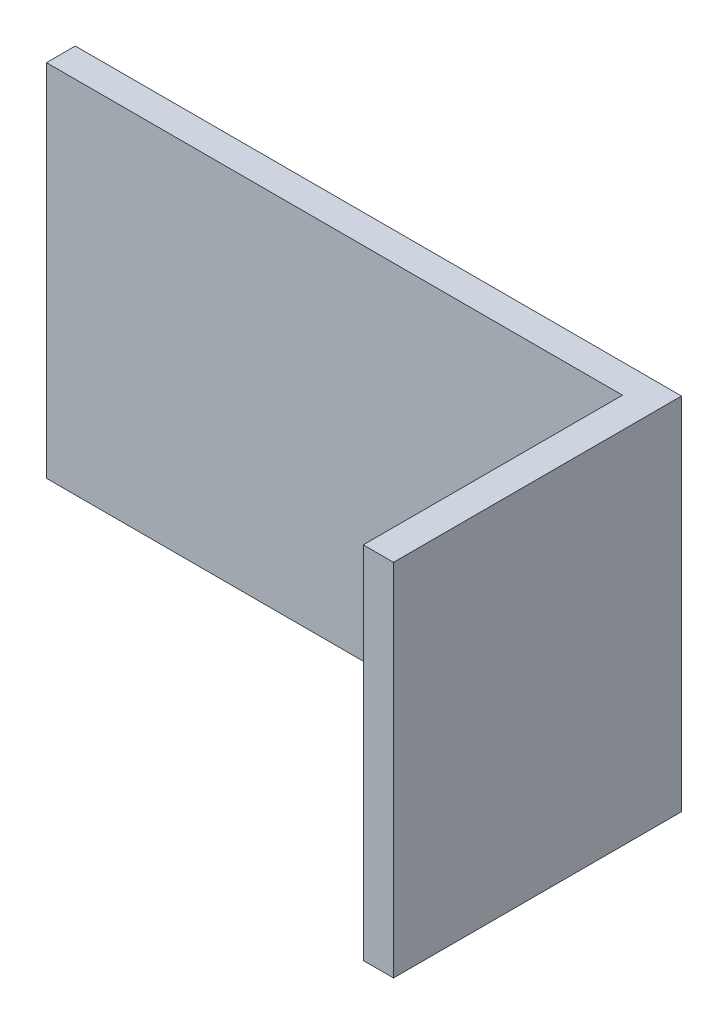
ISO-10303-21;
HEADER;
FILE_DESCRIPTION(('STEP AP214'),'2;1');
FILE_NAME('part.step','',(''),(''),'','','');
FILE_SCHEMA(('AUTOMOTIVE_DESIGN { 1 0 10303 214 1 1 1 1 }'));
ENDSEC;
DATA;
#1=APPLICATION_CONTEXT('core data for automotive mechanical design processes');
#2=APPLICATION_PROTOCOL_DEFINITION('international standard','automotive_design',2000,#1);
#3=PRODUCT_CONTEXT('',#1,'mechanical');
#4=PRODUCT('Part','Part','',(#3));
#5=PRODUCT_RELATED_PRODUCT_CATEGORY('part','',(#4));
#6=PRODUCT_DEFINITION_FORMATION('','',#4);
#7=PRODUCT_DEFINITION_CONTEXT('part definition',#1,'design');
#8=PRODUCT_DEFINITION('design','',#6,#7);
#9=PRODUCT_DEFINITION_SHAPE('','',#8);
#10=(LENGTH_UNIT() NAMED_UNIT(*) SI_UNIT(.MILLI.,.METRE.));
#11=(NAMED_UNIT(*) PLANE_ANGLE_UNIT() SI_UNIT($,.RADIAN.));
#12=(NAMED_UNIT(*) SI_UNIT($,.STERADIAN.) SOLID_ANGLE_UNIT());
#13=UNCERTAINTY_MEASURE_WITH_UNIT(LENGTH_MEASURE(1.E-05),#10,'distance_accuracy_value','');
#14=(GEOMETRIC_REPRESENTATION_CONTEXT(3) GLOBAL_UNCERTAINTY_ASSIGNED_CONTEXT((#13)) GLOBAL_UNIT_ASSIGNED_CONTEXT((#10,
#11,#12)) REPRESENTATION_CONTEXT('',''));
#15=CARTESIAN_POINT('',(0.,0.,0.));
#16=DIRECTION('',(0.,0.,1.));
#17=DIRECTION('',(1.,0.,0.));
#18=AXIS2_PLACEMENT_3D('',#15,#16,#17);
#19=CARTESIAN_POINT('',(1.48217930040456,-0.25,0.2));
#20=DIRECTION('',(0.,0.,1.));
#21=DIRECTION('',(1.,0.,0.));
#22=AXIS2_PLACEMENT_3D('',#19,#20,#21);
#23=PLANE('',#22);
#24=DIRECTION('',(0.,-1.,0.));
#25=VECTOR('',#24,1.);
#26=CARTESIAN_POINT('',(1.49267930040456,-0.25,0.2));
#27=LINE('',#26,#25);
#28=CARTESIAN_POINT('',(1.49267930040456,-0.125,0.2));
#29=VERTEX_POINT('',#28);
#30=CARTESIAN_POINT('',(1.49267930040456,-0.375,0.2));
#31=VERTEX_POINT('',#30);
#32=EDGE_CURVE('E76',#29,#31,#27,.T.);
#33=ORIENTED_EDGE('',*,*,#32,.F.);
#34=DIRECTION('',(1.,0.,0.));
#35=VECTOR('',#34,1.);
#36=CARTESIAN_POINT('',(1.34015031489732,-0.125,0.2));
#37=LINE('',#36,#35);
#38=CARTESIAN_POINT('',(1.47167930040457,-0.125,0.2));
#39=VERTEX_POINT('',#38);
#40=EDGE_CURVE('E127',#39,#29,#37,.T.);
#41=ORIENTED_EDGE('',*,*,#40,.F.);
#42=DIRECTION('',(0.,-1.,0.));
#43=VECTOR('',#42,1.);
#44=CARTESIAN_POINT('',(1.47167930040457,-0.25,0.2));
#45=LINE('',#44,#43);
#46=CARTESIAN_POINT('',(1.47167930040457,-0.375,0.2));
#47=VERTEX_POINT('',#46);
#48=EDGE_CURVE('E11',#39,#47,#45,.T.);
#49=ORIENTED_EDGE('',*,*,#48,.T.);
#50=DIRECTION('',(1.,0.,0.));
#51=VECTOR('',#50,1.);
#52=CARTESIAN_POINT('',(1.34015031489732,-0.375,0.2));
#53=LINE('',#52,#51);
#54=EDGE_CURVE('E66',#47,#31,#53,.T.);
#55=ORIENTED_EDGE('',*,*,#54,.T.);
#56=EDGE_LOOP('',(#33,#41,#49,#55));
#57=FACE_BOUND('',#56,.T.);
#58=ADVANCED_FACE('F17',(#57),#23,.T.);
#59=CARTESIAN_POINT('',(1.27167930040456,-0.25,0.02));
#60=DIRECTION('',(0.,0.,1.));
#61=DIRECTION('',(1.,0.,0.));
#62=AXIS2_PLACEMENT_3D('',#59,#60,#61);
#63=PLANE('',#62);
#64=DIRECTION('',(1.,0.,0.));
#65=VECTOR('',#64,1.);
#66=CARTESIAN_POINT('',(1.34015031489732,-0.125,0.02));
#67=LINE('',#66,#65);
#68=CARTESIAN_POINT('',(1.07167930040456,-0.125,0.02));
#69=VERTEX_POINT('',#68);
#70=CARTESIAN_POINT('',(1.47167930040457,-0.125,0.02));
#71=VERTEX_POINT('',#70);
#72=EDGE_CURVE('E110',#69,#71,#67,.T.);
#73=ORIENTED_EDGE('',*,*,#72,.F.);
#74=DIRECTION('',(0.,-1.,0.));
#75=VECTOR('',#74,1.);
#76=CARTESIAN_POINT('',(1.07167930040456,-0.25,0.02));
#77=LINE('',#76,#75);
#78=CARTESIAN_POINT('',(1.07167930040456,-0.375,0.02));
#79=VERTEX_POINT('',#78);
#80=EDGE_CURVE('E40',#69,#79,#77,.T.);
#81=ORIENTED_EDGE('',*,*,#80,.T.);
#82=DIRECTION('',(1.,0.,0.));
#83=VECTOR('',#82,1.);
#84=CARTESIAN_POINT('',(1.34015031489732,-0.375,0.02));
#85=LINE('',#84,#83);
#86=CARTESIAN_POINT('',(1.47167930040457,-0.375,0.02));
#87=VERTEX_POINT('',#86);
#88=EDGE_CURVE('E141',#79,#87,#85,.T.);
#89=ORIENTED_EDGE('',*,*,#88,.T.);
#90=DIRECTION('',(0.,1.,0.));
#91=VECTOR('',#90,1.);
#92=CARTESIAN_POINT('',(1.47167930040457,-0.25,0.02));
#93=LINE('',#92,#91);
#94=EDGE_CURVE('E20',#87,#71,#93,.T.);
#95=ORIENTED_EDGE('',*,*,#94,.T.);
#96=EDGE_LOOP('',(#73,#81,#89,#95));
#97=FACE_BOUND('',#96,.T.);
#98=ADVANCED_FACE('F117',(#97),#63,.T.);
#99=CARTESIAN_POINT('',(1.47167930040457,-0.25,0.11));
#100=DIRECTION('',(1.,0.,0.));
#101=DIRECTION('',(0.,0.,1.));
#102=AXIS2_PLACEMENT_3D('',#99,#100,#101);
#103=PLANE('',#102);
#104=DIRECTION('',(0.,0.,1.));
#105=VECTOR('',#104,1.);
#106=CARTESIAN_POINT('',(1.47167930040457,-0.125,0.0420289855072459));
#107=LINE('',#106,#105);
#108=EDGE_CURVE('E120',#71,#39,#107,.T.);
#109=ORIENTED_EDGE('',*,*,#108,.F.);
#110=ORIENTED_EDGE('',*,*,#94,.F.);
#111=DIRECTION('',(0.,0.,1.));
#112=VECTOR('',#111,1.);
#113=CARTESIAN_POINT('',(1.47167930040457,-0.375,0.0420289855072459));
#114=LINE('',#113,#112);
#115=EDGE_CURVE('E144',#87,#47,#114,.T.);
#116=ORIENTED_EDGE('',*,*,#115,.T.);
#117=ORIENTED_EDGE('',*,*,#48,.F.);
#118=EDGE_LOOP('',(#109,#110,#116,#117));
#119=FACE_BOUND('',#118,.T.);
#120=ADVANCED_FACE('F239',(#119),#103,.F.);
#121=CARTESIAN_POINT('',(1.07167930040456,-0.25,0.01));
#122=DIRECTION('',(1.,0.,0.));
#123=DIRECTION('',(0.,0.,1.));
#124=AXIS2_PLACEMENT_3D('',#121,#122,#123);
#125=PLANE('',#124);
#126=DIRECTION('',(0.,0.,1.));
#127=VECTOR('',#126,1.);
#128=CARTESIAN_POINT('',(1.07167930040456,-0.375,0.0420289855072459));
#129=LINE('',#128,#127);
#130=CARTESIAN_POINT('',(1.07167930040456,-0.375,0.));
#131=VERTEX_POINT('',#130);
#132=EDGE_CURVE('E102',#131,#79,#129,.T.);
#133=ORIENTED_EDGE('',*,*,#132,.T.);
#134=ORIENTED_EDGE('',*,*,#80,.F.);
#135=DIRECTION('',(0.,0.,1.));
#136=VECTOR('',#135,1.);
#137=CARTESIAN_POINT('',(1.07167930040456,-0.125,0.0420289855072459));
#138=LINE('',#137,#136);
#139=CARTESIAN_POINT('',(1.07167930040456,-0.125,0.));
#140=VERTEX_POINT('',#139);
#141=EDGE_CURVE('E97',#140,#69,#138,.T.);
#142=ORIENTED_EDGE('',*,*,#141,.F.);
#143=DIRECTION('',(0.,-1.,0.));
#144=VECTOR('',#143,1.);
#145=CARTESIAN_POINT('',(1.07167930040456,-0.25,0.));
#146=LINE('',#145,#144);
#147=EDGE_CURVE('E129',#140,#131,#146,.T.);
#148=ORIENTED_EDGE('',*,*,#147,.T.);
#149=EDGE_LOOP('',(#133,#134,#142,#148));
#150=FACE_BOUND('',#149,.T.);
#151=ADVANCED_FACE('F101',(#150),#125,.F.);
#152=CARTESIAN_POINT('',(1.34015031489732,-0.375,0.0420289855072459));
#153=DIRECTION('',(0.,1.,0.));
#154=DIRECTION('',(0.,0.,-1.));
#155=AXIS2_PLACEMENT_3D('',#152,#153,#154);
#156=PLANE('',#155);
#157=DIRECTION('',(0.,0.,-1.));
#158=VECTOR('',#157,1.);
#159=CARTESIAN_POINT('',(1.49267930040456,-0.375,0.0999999999999988));
#160=LINE('',#159,#158);
#161=CARTESIAN_POINT('',(1.49267930040456,-0.375,0.));
#162=VERTEX_POINT('',#161);
#163=EDGE_CURVE('E138',#31,#162,#160,.T.);
#164=ORIENTED_EDGE('',*,*,#163,.F.);
#165=ORIENTED_EDGE('',*,*,#54,.F.);
#166=ORIENTED_EDGE('',*,*,#115,.F.);
#167=ORIENTED_EDGE('',*,*,#88,.F.);
#168=ORIENTED_EDGE('',*,*,#132,.F.);
#169=DIRECTION('',(1.,0.,0.));
#170=VECTOR('',#169,1.);
#171=CARTESIAN_POINT('',(1.28217930040456,-0.375,0.));
#172=LINE('',#171,#170);
#173=EDGE_CURVE('E215',#131,#162,#172,.T.);
#174=ORIENTED_EDGE('',*,*,#173,.T.);
#175=EDGE_LOOP('',(#164,#165,#166,#167,#168,#174));
#176=FACE_BOUND('',#175,.T.);
#177=ADVANCED_FACE('F236',(#176),#156,.F.);
#178=CARTESIAN_POINT('',(1.49267930040456,-0.25,0.0999999999999988));
#179=DIRECTION('',(1.,0.,0.));
#180=DIRECTION('',(0.,1.,0.));
#181=AXIS2_PLACEMENT_3D('',#178,#179,#180);
#182=PLANE('',#181);
#183=ORIENTED_EDGE('',*,*,#32,.T.);
#184=ORIENTED_EDGE('',*,*,#163,.T.);
#185=DIRECTION('',(0.,1.,0.));
#186=VECTOR('',#185,1.);
#187=CARTESIAN_POINT('',(1.49267930040456,-0.25,0.));
#188=LINE('',#187,#186);
#189=CARTESIAN_POINT('',(1.49267930040456,-0.125,0.));
#190=VERTEX_POINT('',#189);
#191=EDGE_CURVE('E206',#162,#190,#188,.T.);
#192=ORIENTED_EDGE('',*,*,#191,.T.);
#193=DIRECTION('',(0.,0.,-1.));
#194=VECTOR('',#193,1.);
#195=CARTESIAN_POINT('',(1.49267930040456,-0.125,0.0420289855072459));
#196=LINE('',#195,#194);
#197=EDGE_CURVE('E115',#29,#190,#196,.T.);
#198=ORIENTED_EDGE('',*,*,#197,.F.);
#199=EDGE_LOOP('',(#183,#184,#192,#198));
#200=FACE_BOUND('',#199,.T.);
#201=ADVANCED_FACE('F231',(#200),#182,.T.);
#202=CARTESIAN_POINT('',(1.34015031489732,-0.125,0.0420289855072459));
#203=DIRECTION('',(0.,1.,0.));
#204=DIRECTION('',(0.,0.,-1.));
#205=AXIS2_PLACEMENT_3D('',#202,#203,#204);
#206=PLANE('',#205);
#207=ORIENTED_EDGE('',*,*,#72,.T.);
#208=ORIENTED_EDGE('',*,*,#108,.T.);
#209=ORIENTED_EDGE('',*,*,#40,.T.);
#210=ORIENTED_EDGE('',*,*,#197,.T.);
#211=DIRECTION('',(-1.,0.,0.));
#212=VECTOR('',#211,1.);
#213=CARTESIAN_POINT('',(1.28217930040456,-0.125,0.));
#214=LINE('',#213,#212);
#215=EDGE_CURVE('E112',#190,#140,#214,.T.);
#216=ORIENTED_EDGE('',*,*,#215,.T.);
#217=ORIENTED_EDGE('',*,*,#141,.T.);
#218=EDGE_LOOP('',(#207,#208,#209,#210,#216,#217));
#219=FACE_BOUND('',#218,.T.);
#220=ADVANCED_FACE('F108',(#219),#206,.T.);
#221=CARTESIAN_POINT('',(1.28217930040456,-0.25,0.));
#222=DIRECTION('',(0.,0.,1.));
#223=DIRECTION('',(1.,0.,0.));
#224=AXIS2_PLACEMENT_3D('',#221,#222,#223);
#225=PLANE('',#224);
#226=ORIENTED_EDGE('',*,*,#191,.F.);
#227=ORIENTED_EDGE('',*,*,#173,.F.);
#228=ORIENTED_EDGE('',*,*,#147,.F.);
#229=ORIENTED_EDGE('',*,*,#215,.F.);
#230=EDGE_LOOP('',(#226,#227,#228,#229));
#231=FACE_BOUND('',#230,.T.);
#232=ADVANCED_FACE('F234',(#231),#225,.F.);
#233=CLOSED_SHELL('',(#58,#98,#120,#151,#177,#201,#220,#232));
#234=MANIFOLD_SOLID_BREP('B1',#233);
#235=ADVANCED_BREP_SHAPE_REPRESENTATION('',(#18,#234),#14);
#236=SHAPE_DEFINITION_REPRESENTATION(#9,#235);
ENDSEC;
END-ISO-10303-21;
